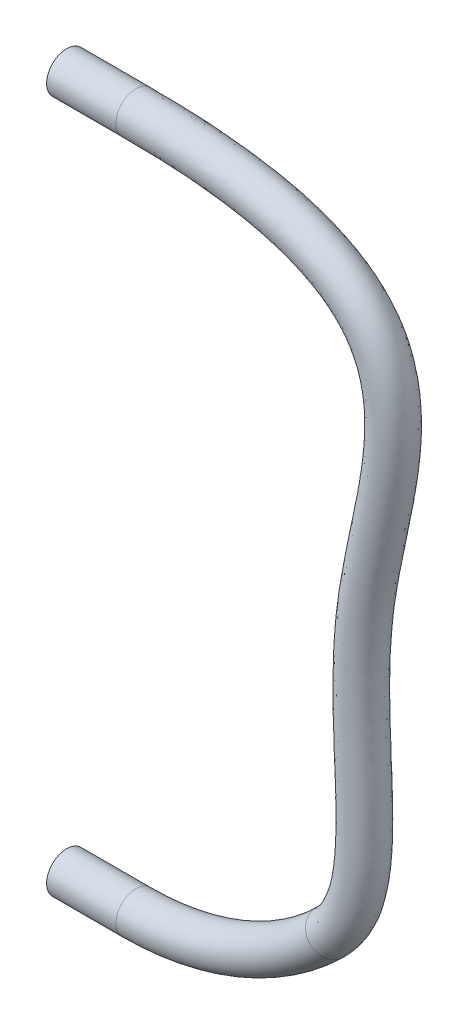
ISO-10303-21;
HEADER;
FILE_DESCRIPTION(('STEP AP214'),'2;1');
FILE_NAME('part.step','',(''),(''),'','','');
FILE_SCHEMA(('AUTOMOTIVE_DESIGN { 1 0 10303 214 1 1 1 1 }'));
ENDSEC;
DATA;
#1=APPLICATION_CONTEXT('core data for automotive mechanical design processes');
#2=APPLICATION_PROTOCOL_DEFINITION('international standard','automotive_design',2000,#1);
#3=PRODUCT_CONTEXT('',#1,'mechanical');
#4=PRODUCT('Part','Part','',(#3));
#5=PRODUCT_RELATED_PRODUCT_CATEGORY('part','',(#4));
#6=PRODUCT_DEFINITION_FORMATION('','',#4);
#7=PRODUCT_DEFINITION_CONTEXT('part definition',#1,'design');
#8=PRODUCT_DEFINITION('design','',#6,#7);
#9=PRODUCT_DEFINITION_SHAPE('','',#8);
#10=(LENGTH_UNIT() NAMED_UNIT(*) SI_UNIT(.MILLI.,.METRE.));
#11=(NAMED_UNIT(*) PLANE_ANGLE_UNIT() SI_UNIT($,.RADIAN.));
#12=(NAMED_UNIT(*) SI_UNIT($,.STERADIAN.) SOLID_ANGLE_UNIT());
#13=UNCERTAINTY_MEASURE_WITH_UNIT(LENGTH_MEASURE(1.E-05),#10,'distance_accuracy_value','');
#14=(GEOMETRIC_REPRESENTATION_CONTEXT(3) GLOBAL_UNCERTAINTY_ASSIGNED_CONTEXT((#13)) GLOBAL_UNIT_ASSIGNED_CONTEXT((#10,
#11,#12)) REPRESENTATION_CONTEXT('',''));
#15=CARTESIAN_POINT('',(0.,0.,0.));
#16=DIRECTION('',(0.,0.,1.));
#17=DIRECTION('',(1.,0.,0.));
#18=AXIS2_PLACEMENT_3D('',#15,#16,#17);
#19=CARTESIAN_POINT('',(49.9999999999996,500.,0.));
#20=DIRECTION('',(-1.,0.,0.));
#21=DIRECTION('',(0.,0.,1.));
#22=AXIS2_PLACEMENT_3D('',#19,#20,#21);
#23=CYLINDRICAL_SURFACE('',#22,14.5);
#24=CARTESIAN_POINT('',(49.9999999999996,500.,0.));
#25=DIRECTION('',(-1.,0.,0.));
#26=DIRECTION('',(0.,0.,-1.));
#27=AXIS2_PLACEMENT_3D('',#24,#25,#26);
#28=CIRCLE('',#27,14.5);
#29=CARTESIAN_POINT('',(49.9999999999996,500.,14.5));
#30=VERTEX_POINT('',#29);
#31=EDGE_CURVE('E70',#30,#30,#28,.T.);
#32=CARTESIAN_POINT('',(-3.95516952522712E-13,500.,0.));
#33=DIRECTION('',(-1.,0.,0.));
#34=DIRECTION('',(0.,0.,-1.));
#35=AXIS2_PLACEMENT_3D('',#32,#33,#34);
#36=CIRCLE('',#35,14.5);
#37=CARTESIAN_POINT('',(-3.95516952522712E-13,500.,14.5));
#38=VERTEX_POINT('',#37);
#39=EDGE_CURVE('E11',#38,#38,#36,.T.);
#40=CARTESIAN_POINT('',(49.9999999999996,500.,14.5));
#41=CARTESIAN_POINT('',(49.4791666666663,500.,14.5));
#42=CARTESIAN_POINT('',(48.9583333333329,500.,14.5));
#43=CARTESIAN_POINT('',(47.9166666666663,500.,14.5));
#44=CARTESIAN_POINT('',(47.3958333333329,500.,14.5));
#45=CARTESIAN_POINT('',(46.3541666666663,500.,14.5));
#46=CARTESIAN_POINT('',(45.8333333333329,500.,14.5));
#47=CARTESIAN_POINT('',(44.7916666666663,500.,14.5));
#48=CARTESIAN_POINT('',(44.2708333333329,500.,14.5));
#49=CARTESIAN_POINT('',(43.2291666666663,500.,14.5));
#50=CARTESIAN_POINT('',(42.7083333333329,500.,14.5));
#51=CARTESIAN_POINT('',(41.6666666666663,500.,14.5));
#52=CARTESIAN_POINT('',(41.1458333333329,500.,14.5));
#53=CARTESIAN_POINT('',(40.1041666666663,500.,14.5));
#54=CARTESIAN_POINT('',(39.5833333333329,500.,14.5));
#55=CARTESIAN_POINT('',(38.5416666666663,500.,14.5));
#56=CARTESIAN_POINT('',(38.0208333333329,500.,14.5));
#57=CARTESIAN_POINT('',(36.9791666666663,500.,14.5));
#58=CARTESIAN_POINT('',(36.4583333333329,500.,14.5));
#59=CARTESIAN_POINT('',(35.4166666666663,500.,14.5));
#60=CARTESIAN_POINT('',(34.8958333333329,500.,14.5));
#61=CARTESIAN_POINT('',(33.8541666666663,500.,14.5));
#62=CARTESIAN_POINT('',(33.3333333333329,500.,14.5));
#63=CARTESIAN_POINT('',(32.2916666666663,500.,14.5));
#64=CARTESIAN_POINT('',(31.7708333333329,500.,14.5));
#65=CARTESIAN_POINT('',(30.7291666666663,500.,14.5));
#66=CARTESIAN_POINT('',(30.2083333333329,500.,14.5));
#67=CARTESIAN_POINT('',(29.1666666666663,500.,14.5));
#68=CARTESIAN_POINT('',(28.6458333333329,500.,14.5));
#69=CARTESIAN_POINT('',(27.6041666666663,500.,14.5));
#70=CARTESIAN_POINT('',(27.0833333333329,500.,14.5));
#71=CARTESIAN_POINT('',(26.0416666666663,500.,14.5));
#72=CARTESIAN_POINT('',(25.5208333333329,500.,14.5));
#73=CARTESIAN_POINT('',(24.4791666666663,500.,14.5));
#74=CARTESIAN_POINT('',(23.9583333333329,500.,14.5));
#75=CARTESIAN_POINT('',(22.9166666666663,500.,14.5));
#76=CARTESIAN_POINT('',(22.3958333333329,500.,14.5));
#77=CARTESIAN_POINT('',(21.3541666666663,500.,14.5));
#78=CARTESIAN_POINT('',(20.8333333333329,500.,14.5));
#79=CARTESIAN_POINT('',(19.7916666666663,500.,14.5));
#80=CARTESIAN_POINT('',(19.2708333333329,500.,14.5));
#81=CARTESIAN_POINT('',(18.2291666666663,500.,14.5));
#82=CARTESIAN_POINT('',(17.7083333333329,500.,14.5));
#83=CARTESIAN_POINT('',(16.6666666666663,500.,14.5));
#84=CARTESIAN_POINT('',(16.1458333333329,500.,14.5));
#85=CARTESIAN_POINT('',(15.1041666666663,500.,14.5));
#86=CARTESIAN_POINT('',(14.5833333333329,500.,14.5));
#87=CARTESIAN_POINT('',(13.5416666666663,500.,14.5));
#88=CARTESIAN_POINT('',(13.0208333333329,500.,14.5));
#89=CARTESIAN_POINT('',(11.9791666666663,500.,14.5));
#90=CARTESIAN_POINT('',(11.4583333333329,500.,14.5));
#91=CARTESIAN_POINT('',(10.4166666666663,500.,14.5));
#92=CARTESIAN_POINT('',(9.89583333333294,500.,14.5));
#93=CARTESIAN_POINT('',(8.85416666666627,500.,14.5));
#94=CARTESIAN_POINT('',(8.33333333333294,500.,14.5));
#95=CARTESIAN_POINT('',(7.29166666666627,500.,14.5));
#96=CARTESIAN_POINT('',(6.77083333333294,500.,14.5));
#97=CARTESIAN_POINT('',(5.72916666666627,500.,14.5));
#98=CARTESIAN_POINT('',(5.20833333333294,500.,14.5));
#99=CARTESIAN_POINT('',(4.16666666666627,500.,14.5));
#100=CARTESIAN_POINT('',(3.64583333333294,500.,14.5));
#101=CARTESIAN_POINT('',(2.60416666666627,500.,14.5));
#102=CARTESIAN_POINT('',(2.08333333333294,500.,14.5));
#103=CARTESIAN_POINT('',(1.04166666666627,500.,14.5));
#104=CARTESIAN_POINT('',(0.520833333332938,500.,14.5));
#105=CARTESIAN_POINT('',(-3.95516952522712E-13,500.,14.5));
#106=B_SPLINE_CURVE_WITH_KNOTS('',3,(#40,#41,#42,#43,#44,#45,#46,#47,#48,#49,#50,#51,#52,#53,
#54,#55,#56,#57,#58,#59,#60,#61,#62,#63,#64,#65,#66,#67,#68,#69,#70,#71,#72,#73,#74,#75,#76,#77,
#78,#79,#80,#81,#82,#83,#84,#85,#86,#87,#88,#89,#90,#91,#92,#93,#94,#95,#96,#97,#98,#99,#100,
#101,#102,#103,#104,#105),.UNSPECIFIED.,.F.,.F.,(4,2,2,2,2,2,2,2,2,2,2,2,2,2,2,2,2,2,2,2,2,2,2,
2,2,2,2,2,2,2,2,2,4),(0.,1.56249999999999,3.125,4.6875,6.25,7.81249999999999,9.37499999999999,
10.9375,12.5,14.0625,15.625,17.1875,18.75,20.3125,21.875,23.4375,25.,26.5625,28.125,29.6875,
31.25,32.8125,34.375,35.9375,37.5,39.0625,40.625,42.1875,43.75,45.3125,46.875,48.4375,50.),.UNSPECIFIED.);
#107=EDGE_CURVE('BSEAM52',#30,#38,#106,.T.);
#108=ORIENTED_EDGE('',*,*,#31,.T.);
#109=ORIENTED_EDGE('',*,*,#39,.F.);
#110=ORIENTED_EDGE('',*,*,#107,.T.);
#111=ORIENTED_EDGE('',*,*,#107,.F.);
#112=EDGE_LOOP('',(#108,#110,#109,#111));
#113=FACE_BOUND('',#112,.T.);
#114=ADVANCED_FACE('F52',(#113),#23,.T.);
#115=CARTESIAN_POINT('',(50.,200.,0.));
#116=DIRECTION('',(0.,0.,1.));
#117=DIRECTION('',(1.,0.,0.));
#118=AXIS2_PLACEMENT_3D('',#115,#116,#117);
#119=TOROIDAL_SURFACE('',#118,200.,14.5);
#120=CARTESIAN_POINT('',(50.,0.,0.));
#121=DIRECTION('',(1.,0.,0.));
#122=DIRECTION('',(0.,0.,-1.));
#123=AXIS2_PLACEMENT_3D('',#120,#121,#122);
#124=CIRCLE('',#123,14.5);
#125=CARTESIAN_POINT('',(50.,-14.5,0.));
#126=VERTEX_POINT('',#125);
#127=EDGE_CURVE('E62',#126,#126,#124,.T.);
#128=CARTESIAN_POINT('',(190.,57.171431429143,0.));
#129=DIRECTION('',(0.714142842854285,0.7,0.));
#130=DIRECTION('',(0.,0.,-1.));
#131=AXIS2_PLACEMENT_3D('',#128,#129,#130);
#132=CIRCLE('',#131,14.5);
#133=CARTESIAN_POINT('',(200.15,46.8163602077558,0.));
#134=VERTEX_POINT('',#133);
#135=EDGE_CURVE('E58',#134,#134,#132,.T.);
#136=CARTESIAN_POINT('',(50.,200.,0.));
#137=DIRECTION('',(0.,0.,1.));
#138=DIRECTION('',(1.,0.,0.));
#139=AXIS2_PLACEMENT_3D('',#136,#137,#138);
#140=CIRCLE('',#139,214.5);
#141=EDGE_CURVE('',#126,#134,#140,.T.);
#142=ORIENTED_EDGE('',*,*,#127,.T.);
#143=ORIENTED_EDGE('',*,*,#135,.F.);
#144=ORIENTED_EDGE('',*,*,#141,.T.);
#145=ORIENTED_EDGE('',*,*,#141,.F.);
#146=EDGE_LOOP('',(#142,#144,#143,#145));
#147=FACE_BOUND('',#146,.T.);
#148=ADVANCED_FACE('F89',(#147),#119,.T.);
#149=CARTESIAN_POINT('',(50.,0.,0.));
#150=DIRECTION('',(-1.,0.,0.));
#151=DIRECTION('',(0.,0.,1.));
#152=AXIS2_PLACEMENT_3D('',#149,#150,#151);
#153=CYLINDRICAL_SURFACE('',#152,14.5);
#154=ORIENTED_EDGE('',*,*,#127,.F.);
#155=EDGE_LOOP('',(#154));
#156=FACE_BOUND('',#155,.T.);
#157=CARTESIAN_POINT('',(0.,0.,0.));
#158=DIRECTION('',(1.,0.,0.));
#159=DIRECTION('',(0.,0.,-1.));
#160=AXIS2_PLACEMENT_3D('',#157,#158,#159);
#161=CIRCLE('',#160,14.5);
#162=CARTESIAN_POINT('',(0.,0.,-14.5));
#163=VERTEX_POINT('',#162);
#164=EDGE_CURVE('E66',#163,#163,#161,.T.);
#165=ORIENTED_EDGE('',*,*,#164,.T.);
#166=EDGE_LOOP('',(#165));
#167=FACE_BOUND('',#166,.T.);
#168=ADVANCED_FACE('F93',(#156,#167),#153,.T.);
#169=CARTESIAN_POINT('',(0.,0.,0.));
#170=DIRECTION('',(1.,0.,0.));
#171=DIRECTION('',(0.,0.,-1.));
#172=AXIS2_PLACEMENT_3D('',#169,#170,#171);
#173=PLANE('',#172);
#174=ORIENTED_EDGE('',*,*,#164,.F.);
#175=EDGE_LOOP('',(#174));
#176=FACE_BOUND('',#175,.T.);
#177=ADVANCED_FACE('F84',(#176),#173,.F.);
#178=CARTESIAN_POINT('',(-3.95516952522712E-13,500.,0.));
#179=DIRECTION('',(-1.,0.,0.));
#180=DIRECTION('',(0.,0.,-1.));
#181=AXIS2_PLACEMENT_3D('',#178,#179,#180);
#182=PLANE('',#181);
#183=ORIENTED_EDGE('',*,*,#39,.T.);
#184=EDGE_LOOP('',(#183));
#185=FACE_BOUND('',#184,.T.);
#186=ADVANCED_FACE('F79',(#185),#182,.T.);
#187=CARTESIAN_POINT('',(190.,57.171431429143,-14.5));
#188=CARTESIAN_POINT('',(194.944842449833,62.0183465099527,-14.5));
#189=CARTESIAN_POINT('',(202.951550368549,72.6929623445116,-14.5));
#190=CARTESIAN_POINT('',(210.31382625523,91.4075178971451,-14.5));
#191=CARTESIAN_POINT('',(214.029461101954,112.584980032532,-14.5));
#192=CARTESIAN_POINT('',(215.863984687444,152.700368889867,-14.5));
#193=CARTESIAN_POINT('',(211.280771673984,206.672860303372,-14.5));
#194=CARTESIAN_POINT('',(213.566897052587,258.982853629339,-14.5));
#195=CARTESIAN_POINT('',(219.6745617368,300.751303923281,-14.5));
#196=CARTESIAN_POINT('',(228.070292093363,336.023093604827,-14.5));
#197=CARTESIAN_POINT('',(235.140291346087,377.834515537395,-14.5));
#198=CARTESIAN_POINT('',(236.335787132934,408.040783120431,-14.5));
#199=CARTESIAN_POINT('',(231.831090363544,430.49628507942,-14.5));
#200=CARTESIAN_POINT('',(224.082473035944,446.277167583779,-14.5));
#201=CARTESIAN_POINT('',(216.420618309054,456.714655245031,-14.5));
#202=CARTESIAN_POINT('',(206.399580794928,466.235012824428,-14.5));
#203=CARTESIAN_POINT('',(193.787305770649,474.755681510549,-14.5));
#204=CARTESIAN_POINT('',(174.921612456109,483.847084932289,-14.5));
#205=CARTESIAN_POINT('',(146.74142116915,492.348139726263,-14.5));
#206=CARTESIAN_POINT('',(104.664413539392,498.539258728495,-14.5));
#207=CARTESIAN_POINT('',(69.5225886398515,500.,-14.5));
#208=CARTESIAN_POINT('',(49.9999999999996,500.,-14.5));
#209=CARTESIAN_POINT('',(169.7,77.8815738719173,-14.5));
#210=CARTESIAN_POINT('',(174.644842449833,82.728488952727,-14.5));
#211=CARTESIAN_POINT('',(176.230611912776,85.843605342476,-14.5));
#212=CARTESIAN_POINT('',(182.332309903121,99.0837889498667,-14.5));
#213=CARTESIAN_POINT('',(185.0208752628,115.286778973782,-14.5));
#214=CARTESIAN_POINT('',(186.887253376729,150.924680172337,-14.5));
#215=CARTESIAN_POINT('',(182.133285549426,204.768076251786,-14.5));
#216=CARTESIAN_POINT('',(184.748735663511,261.950203556697,-14.5));
#217=CARTESIAN_POINT('',(191.15479980805,306.446688638503,-14.5));
#218=CARTESIAN_POINT('',(199.82131627766,342.618763312055,-14.5));
#219=CARTESIAN_POINT('',(206.287671065404,381.34541559297,-14.5));
#220=CARTESIAN_POINT('',(207.110284171086,406.509956650255,-14.5));
#221=CARTESIAN_POINT('',(203.803730261991,421.741423388913,-14.5));
#222=CARTESIAN_POINT('',(199.147742739472,431.164642376791,-14.5));
#223=CARTESIAN_POINT('',(194.618243954749,437.354918237821,-14.5));
#224=CARTESIAN_POINT('',(188.308717536378,443.396620476437,-14.5));
#225=CARTESIAN_POINT('',(179.496918086823,449.405585731971,-14.5));
#226=CARTESIAN_POINT('',(164.899448228437,456.488020905377,-14.5));
#227=CARTESIAN_POINT('',(140.969785721538,463.848970750561,-14.5));
#228=CARTESIAN_POINT('',(101.934320374639,469.589409808704,-14.5));
#229=CARTESIAN_POINT('',(69.5225886398517,471.,-14.5));
#230=CARTESIAN_POINT('',(49.9999999999998,471.,-14.5));
#231=CARTESIAN_POINT('',(169.7,77.8815738719173,14.5));
#232=CARTESIAN_POINT('',(174.644842449833,82.728488952727,14.5));
#233=CARTESIAN_POINT('',(176.230611912776,85.843605342476,14.5));
#234=CARTESIAN_POINT('',(182.332309903121,99.0837889498667,14.5));
#235=CARTESIAN_POINT('',(185.0208752628,115.286778973782,14.5));
#236=CARTESIAN_POINT('',(186.887253376729,150.924680172337,14.5));
#237=CARTESIAN_POINT('',(182.133285549426,204.768076251786,14.5));
#238=CARTESIAN_POINT('',(184.748735663511,261.950203556697,14.5));
#239=CARTESIAN_POINT('',(191.15479980805,306.446688638503,14.5));
#240=CARTESIAN_POINT('',(199.82131627766,342.618763312055,14.5));
#241=CARTESIAN_POINT('',(206.287671065404,381.34541559297,14.5));
#242=CARTESIAN_POINT('',(207.110284171086,406.509956650255,14.5));
#243=CARTESIAN_POINT('',(203.803730261991,421.741423388913,14.5));
#244=CARTESIAN_POINT('',(199.147742739472,431.164642376791,14.5));
#245=CARTESIAN_POINT('',(194.618243954749,437.354918237821,14.5));
#246=CARTESIAN_POINT('',(188.308717536378,443.396620476437,14.5));
#247=CARTESIAN_POINT('',(179.496918086823,449.405585731971,14.5));
#248=CARTESIAN_POINT('',(164.899448228437,456.488020905377,14.5));
#249=CARTESIAN_POINT('',(140.969785721538,463.848970750561,14.5));
#250=CARTESIAN_POINT('',(101.934320374639,469.589409808704,14.5));
#251=CARTESIAN_POINT('',(69.5225886398517,471.,14.5));
#252=CARTESIAN_POINT('',(49.9999999999998,471.,14.5));
#253=CARTESIAN_POINT('',(190.,57.171431429143,14.5));
#254=CARTESIAN_POINT('',(194.944842449833,62.0183465099527,14.5));
#255=CARTESIAN_POINT('',(202.951550368549,72.6929623445116,14.5));
#256=CARTESIAN_POINT('',(210.31382625523,91.4075178971451,14.5));
#257=CARTESIAN_POINT('',(214.029461101954,112.584980032532,14.5));
#258=CARTESIAN_POINT('',(215.863984687444,152.700368889867,14.5));
#259=CARTESIAN_POINT('',(211.280771673984,206.672860303372,14.5));
#260=CARTESIAN_POINT('',(213.566897052587,258.982853629339,14.5));
#261=CARTESIAN_POINT('',(219.6745617368,300.751303923281,14.5));
#262=CARTESIAN_POINT('',(228.070292093363,336.023093604827,14.5));
#263=CARTESIAN_POINT('',(235.140291346087,377.834515537395,14.5));
#264=CARTESIAN_POINT('',(236.335787132934,408.040783120431,14.5));
#265=CARTESIAN_POINT('',(231.831090363544,430.49628507942,14.5));
#266=CARTESIAN_POINT('',(224.082473035944,446.277167583779,14.5));
#267=CARTESIAN_POINT('',(216.420618309054,456.714655245031,14.5));
#268=CARTESIAN_POINT('',(206.399580794928,466.235012824428,14.5));
#269=CARTESIAN_POINT('',(193.787305770649,474.755681510549,14.5));
#270=CARTESIAN_POINT('',(174.921612456109,483.847084932289,14.5));
#271=CARTESIAN_POINT('',(146.74142116915,492.348139726263,14.5));
#272=CARTESIAN_POINT('',(104.664413539392,498.539258728495,14.5));
#273=CARTESIAN_POINT('',(69.5225886398515,500.,14.5));
#274=CARTESIAN_POINT('',(49.9999999999996,500.,14.5));
#275=CARTESIAN_POINT('',(210.3,36.4612889863687,14.5));
#276=CARTESIAN_POINT('',(215.244842449833,41.3082040671785,14.5));
#277=CARTESIAN_POINT('',(229.672488824321,59.5423193465473,14.5));
#278=CARTESIAN_POINT('',(238.295342607339,83.7312468444234,14.5));
#279=CARTESIAN_POINT('',(243.038046941108,109.883181091283,14.5));
#280=CARTESIAN_POINT('',(244.840715998159,154.476057607397,14.5));
#281=CARTESIAN_POINT('',(240.428257798541,208.577644354958,14.5));
#282=CARTESIAN_POINT('',(242.385058441662,256.015503701982,14.5));
#283=CARTESIAN_POINT('',(248.194323665551,295.055919208058,14.5));
#284=CARTESIAN_POINT('',(256.319267909066,329.4274238976,14.5));
#285=CARTESIAN_POINT('',(263.99291162677,374.323615481819,14.5));
#286=CARTESIAN_POINT('',(265.561290094783,409.571609590608,14.5));
#287=CARTESIAN_POINT('',(259.858450465097,439.251146769926,14.5));
#288=CARTESIAN_POINT('',(249.017203332416,461.389692790767,14.5));
#289=CARTESIAN_POINT('',(238.222992663359,476.074392252241,14.5));
#290=CARTESIAN_POINT('',(224.490444053477,489.073405172419,14.5));
#291=CARTESIAN_POINT('',(208.077693454475,500.105777289127,14.5));
#292=CARTESIAN_POINT('',(184.943776683782,511.206148959202,14.5));
#293=CARTESIAN_POINT('',(152.513056616762,520.847308701964,14.5));
#294=CARTESIAN_POINT('',(107.394506704145,527.489107648285,14.5));
#295=CARTESIAN_POINT('',(69.5225886398513,529.,14.5));
#296=CARTESIAN_POINT('',(49.9999999999994,529.,14.5));
#297=CARTESIAN_POINT('',(210.3,36.4612889863687,-14.5));
#298=CARTESIAN_POINT('',(215.244842449833,41.3082040671785,-14.5));
#299=CARTESIAN_POINT('',(229.672488824321,59.5423193465473,-14.5));
#300=CARTESIAN_POINT('',(238.295342607339,83.7312468444234,-14.5));
#301=CARTESIAN_POINT('',(243.038046941108,109.883181091283,-14.5));
#302=CARTESIAN_POINT('',(244.840715998159,154.476057607397,-14.5));
#303=CARTESIAN_POINT('',(240.428257798541,208.577644354958,-14.5));
#304=CARTESIAN_POINT('',(242.385058441662,256.015503701982,-14.5));
#305=CARTESIAN_POINT('',(248.194323665551,295.055919208058,-14.5));
#306=CARTESIAN_POINT('',(256.319267909066,329.4274238976,-14.5));
#307=CARTESIAN_POINT('',(263.99291162677,374.323615481819,-14.5));
#308=CARTESIAN_POINT('',(265.561290094783,409.571609590608,-14.5));
#309=CARTESIAN_POINT('',(259.858450465097,439.251146769926,-14.5));
#310=CARTESIAN_POINT('',(249.017203332416,461.389692790767,-14.5));
#311=CARTESIAN_POINT('',(238.222992663359,476.074392252241,-14.5));
#312=CARTESIAN_POINT('',(224.490444053477,489.073405172419,-14.5));
#313=CARTESIAN_POINT('',(208.077693454475,500.105777289127,-14.5));
#314=CARTESIAN_POINT('',(184.943776683782,511.206148959202,-14.5));
#315=CARTESIAN_POINT('',(152.513056616762,520.847308701964,-14.5));
#316=CARTESIAN_POINT('',(107.394506704145,527.489107648285,-14.5));
#317=CARTESIAN_POINT('',(69.5225886398513,529.,-14.5));
#318=CARTESIAN_POINT('',(49.9999999999994,529.,-14.5));
#319=CARTESIAN_POINT('',(190.,57.171431429143,-14.5));
#320=CARTESIAN_POINT('',(194.944842449833,62.0183465099527,-14.5));
#321=CARTESIAN_POINT('',(202.951550368549,72.6929623445116,-14.5));
#322=CARTESIAN_POINT('',(210.31382625523,91.4075178971451,-14.5));
#323=CARTESIAN_POINT('',(214.029461101954,112.584980032532,-14.5));
#324=CARTESIAN_POINT('',(215.863984687444,152.700368889867,-14.5));
#325=CARTESIAN_POINT('',(211.280771673984,206.672860303372,-14.5));
#326=CARTESIAN_POINT('',(213.566897052587,258.982853629339,-14.5));
#327=CARTESIAN_POINT('',(219.6745617368,300.751303923281,-14.5));
#328=CARTESIAN_POINT('',(228.070292093363,336.023093604827,-14.5));
#329=CARTESIAN_POINT('',(235.140291346087,377.834515537395,-14.5));
#330=CARTESIAN_POINT('',(236.335787132934,408.040783120431,-14.5));
#331=CARTESIAN_POINT('',(231.831090363544,430.49628507942,-14.5));
#332=CARTESIAN_POINT('',(224.082473035944,446.277167583779,-14.5));
#333=CARTESIAN_POINT('',(216.420618309054,456.714655245031,-14.5));
#334=CARTESIAN_POINT('',(206.399580794928,466.235012824428,-14.5));
#335=CARTESIAN_POINT('',(193.787305770649,474.755681510549,-14.5));
#336=CARTESIAN_POINT('',(174.921612456109,483.847084932289,-14.5));
#337=CARTESIAN_POINT('',(146.74142116915,492.348139726263,-14.5));
#338=CARTESIAN_POINT('',(104.664413539392,498.539258728495,-14.5));
#339=CARTESIAN_POINT('',(69.5225886398515,500.,-14.5));
#340=CARTESIAN_POINT('',(49.9999999999996,500.,-14.5));
#341=(BOUNDED_SURFACE() B_SPLINE_SURFACE(3,3,((#187,#188,#189,#190,#191,#192,#193,#194,#195,
#196,#197,#198,#199,#200,#201,#202,#203,#204,#205,#206,#207,#208),(#209,#210,#211,#212,#213,
#214,#215,#216,#217,#218,#219,#220,#221,#222,#223,#224,#225,#226,#227,#228,#229,#230),(#231,
#232,#233,#234,#235,#236,#237,#238,#239,#240,#241,#242,#243,#244,#245,#246,#247,#248,#249,#250,
#251,#252),(#253,#254,#255,#256,#257,#258,#259,#260,#261,#262,#263,#264,#265,#266,#267,#268,
#269,#270,#271,#272,#273,#274),(#275,#276,#277,#278,#279,#280,#281,#282,#283,#284,#285,#286,
#287,#288,#289,#290,#291,#292,#293,#294,#295,#296),(#297,#298,#299,#300,#301,#302,#303,#304,
#305,#306,#307,#308,#309,#310,#311,#312,#313,#314,#315,#316,#317,#318),(#319,#320,#321,#322,
#323,#324,#325,#326,#327,#328,#329,#330,#331,#332,#333,#334,#335,#336,#337,#338,#339,#340)),
.UNSPECIFIED.,.T.,.F.,.F.) B_SPLINE_SURFACE_WITH_KNOTS((4,3,4),(4,1,1,1,1,1,1,1,1,1,1,1,1,1,1,1,
1,1,1,4),(0.,0.5,1.),(0.,0.052500000000028,0.105,0.1575,0.21,0.375,0.466511448766878,0.48,
0.584999999999983,0.64,0.695,0.75,0.775,0.8,0.825,0.85,0.875,0.916666666666679,
0.958333333333333,1.),
.UNSPECIFIED.) GEOMETRIC_REPRESENTATION_ITEM() RATIONAL_B_SPLINE_SURFACE(((1.,1.,1.,1.,1.,1.,1.,
1.,1.,1.,1.,1.,1.,1.,1.,1.,1.,1.,1.,1.,1.,1.),(0.333333333333333,0.333333333333333,
0.333333333333334,0.333333333333333,0.333333333333333,0.333333333333333,0.333333333333333,
0.333333333333333,0.333333333333333,0.333333333333333,0.333333333333333,0.333333333333333,
0.333333333333333,0.333333333333333,0.333333333333333,0.333333333333333,0.333333333333333,
0.333333333333333,0.333333333333333,0.333333333333333,0.333333333333333,0.333333333333333),
(0.333333333333333,0.333333333333333,0.333333333333334,0.333333333333333,0.333333333333333,
0.333333333333333,0.333333333333333,0.333333333333333,0.333333333333333,0.333333333333333,
0.333333333333333,0.333333333333333,0.333333333333333,0.333333333333333,0.333333333333333,
0.333333333333333,0.333333333333333,0.333333333333333,0.333333333333333,0.333333333333333,
0.333333333333333,0.333333333333333),(1.,1.,1.,1.,1.,1.,1.,1.,1.,1.,1.,1.,1.,1.,1.,1.,1.,1.,1.,
1.,1.,1.),(0.333333333333333,0.333333333333333,0.333333333333334,0.333333333333333,
0.333333333333333,0.333333333333333,0.333333333333333,0.333333333333333,0.333333333333333,
0.333333333333333,0.333333333333333,0.333333333333333,0.333333333333333,0.333333333333333,
0.333333333333333,0.333333333333333,0.333333333333333,0.333333333333333,0.333333333333333,
0.333333333333333,0.333333333333333,0.333333333333333),(0.333333333333333,0.333333333333333,
0.333333333333334,0.333333333333333,0.333333333333333,0.333333333333333,0.333333333333333,
0.333333333333333,0.333333333333333,0.333333333333333,0.333333333333333,0.333333333333333,
0.333333333333333,0.333333333333333,0.333333333333333,0.333333333333333,0.333333333333333,
0.333333333333333,0.333333333333333,0.333333333333333,0.333333333333333,0.333333333333333),(1.,
1.,1.,1.,1.,1.,1.,1.,1.,1.,1.,1.,1.,1.,1.,1.,1.,1.,1.,1.,1.,1.))) REPRESENTATION_ITEM('') SURFACE());
#342=ORIENTED_EDGE('',*,*,#135,.T.);
#343=EDGE_LOOP('',(#342));
#344=FACE_BOUND('',#343,.T.);
#345=ORIENTED_EDGE('',*,*,#31,.F.);
#346=EDGE_LOOP('',(#345));
#347=FACE_BOUND('',#346,.T.);
#348=ADVANCED_FACE('F77',(#344,#347),#341,.T.);
#349=CLOSED_SHELL('',(#114,#148,#168,#177,#186,#348));
#350=MANIFOLD_SOLID_BREP('B2',#349);
#351=ADVANCED_BREP_SHAPE_REPRESENTATION('',(#18,#350),#14);
#352=SHAPE_DEFINITION_REPRESENTATION(#9,#351);
ENDSEC;
END-ISO-10303-21;
